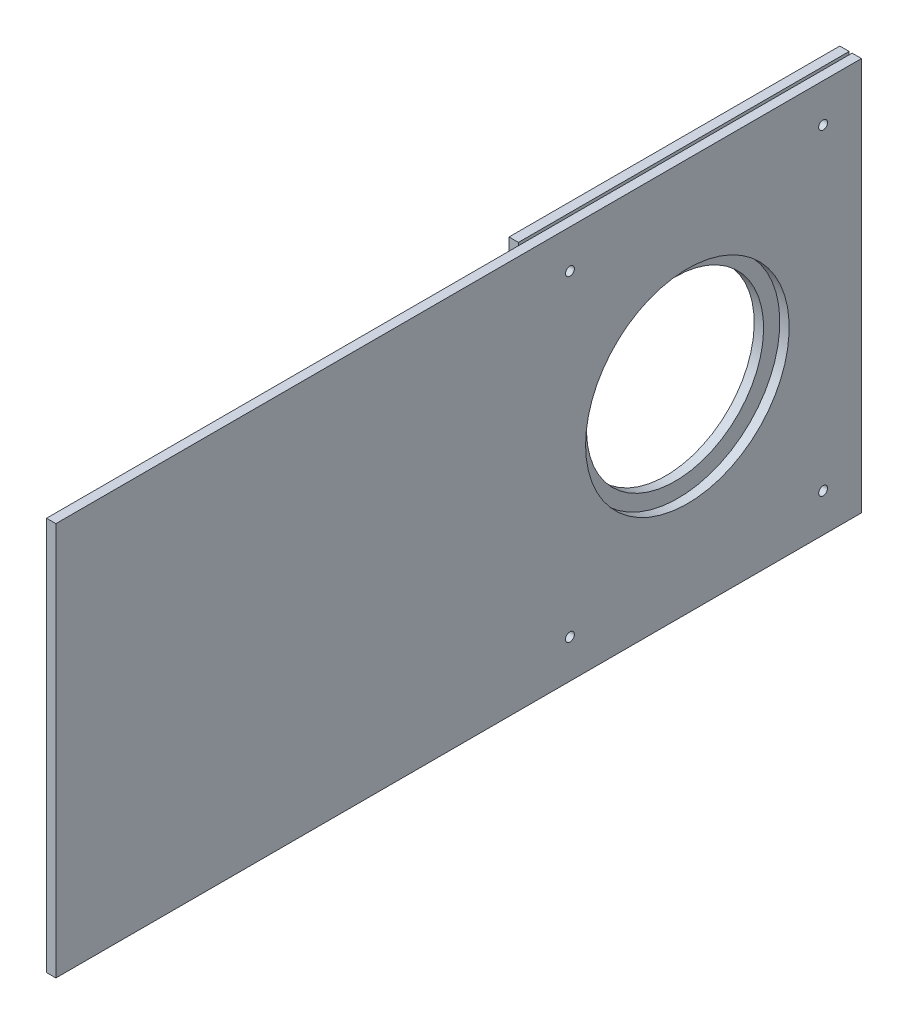
ISO-10303-21;
HEADER;
FILE_DESCRIPTION(('STEP AP214'),'2;1');
FILE_NAME('part.step','',(''),(''),'','','');
FILE_SCHEMA(('AUTOMOTIVE_DESIGN { 1 0 10303 214 1 1 1 1 }'));
ENDSEC;
DATA;
#1=APPLICATION_CONTEXT('core data for automotive mechanical design processes');
#2=APPLICATION_PROTOCOL_DEFINITION('international standard','automotive_design',2000,#1);
#3=PRODUCT_CONTEXT('',#1,'mechanical');
#4=PRODUCT('Part','Part','',(#3));
#5=PRODUCT_RELATED_PRODUCT_CATEGORY('part','',(#4));
#6=PRODUCT_DEFINITION_FORMATION('','',#4);
#7=PRODUCT_DEFINITION_CONTEXT('part definition',#1,'design');
#8=PRODUCT_DEFINITION('design','',#6,#7);
#9=PRODUCT_DEFINITION_SHAPE('','',#8);
#10=(LENGTH_UNIT() NAMED_UNIT(*) SI_UNIT(.MILLI.,.METRE.));
#11=(NAMED_UNIT(*) PLANE_ANGLE_UNIT() SI_UNIT($,.RADIAN.));
#12=(NAMED_UNIT(*) SI_UNIT($,.STERADIAN.) SOLID_ANGLE_UNIT());
#13=UNCERTAINTY_MEASURE_WITH_UNIT(LENGTH_MEASURE(1.E-05),#10,'distance_accuracy_value','');
#14=(GEOMETRIC_REPRESENTATION_CONTEXT(3) GLOBAL_UNCERTAINTY_ASSIGNED_CONTEXT((#13)) GLOBAL_UNIT_ASSIGNED_CONTEXT((#10,
#11,#12)) REPRESENTATION_CONTEXT('',''));
#15=CARTESIAN_POINT('',(0.,0.,0.));
#16=DIRECTION('',(0.,0.,1.));
#17=DIRECTION('',(1.,0.,0.));
#18=AXIS2_PLACEMENT_3D('',#15,#16,#17);
#19=CARTESIAN_POINT('',(-148.584589485562,66.675,273.));
#20=DIRECTION('',(1.,0.,0.));
#21=DIRECTION('',(0.,1.,0.));
#22=AXIS2_PLACEMENT_3D('',#19,#20,#21);
#23=PLANE('',#22);
#24=CARTESIAN_POINT('',(-148.584589485562,-53.675,13.));
#25=DIRECTION('',(1.,0.,0.));
#26=DIRECTION('',(0.,1.,0.));
#27=AXIS2_PLACEMENT_3D('',#24,#25,#26);
#28=CIRCLE('',#27,1.5);
#29=CARTESIAN_POINT('',(-148.584589485562,-52.175,13.));
#30=VERTEX_POINT('',#29);
#31=EDGE_CURVE('E141',#30,#30,#28,.F.);
#32=ORIENTED_EDGE('',*,*,#31,.F.);
#33=EDGE_LOOP('',(#32));
#34=FACE_BOUND('',#33,.T.);
#35=CARTESIAN_POINT('',(-148.584589485562,53.675,13.));
#36=DIRECTION('',(1.,0.,0.));
#37=DIRECTION('',(0.,1.,0.));
#38=AXIS2_PLACEMENT_3D('',#35,#36,#37);
#39=CIRCLE('',#38,1.5);
#40=CARTESIAN_POINT('',(-148.584589485562,55.175,13.));
#41=VERTEX_POINT('',#40);
#42=EDGE_CURVE('E136',#41,#41,#39,.F.);
#43=ORIENTED_EDGE('',*,*,#42,.F.);
#44=EDGE_LOOP('',(#43));
#45=FACE_BOUND('',#44,.T.);
#46=CARTESIAN_POINT('',(-148.584589485562,-53.675,98.7970297029699));
#47=DIRECTION('',(1.,0.,0.));
#48=DIRECTION('',(0.,1.,0.));
#49=AXIS2_PLACEMENT_3D('',#46,#47,#48);
#50=CIRCLE('',#49,1.5);
#51=CARTESIAN_POINT('',(-148.584589485562,-52.175,98.7970297029699));
#52=VERTEX_POINT('',#51);
#53=EDGE_CURVE('E131',#52,#52,#50,.F.);
#54=ORIENTED_EDGE('',*,*,#53,.F.);
#55=EDGE_LOOP('',(#54));
#56=FACE_BOUND('',#55,.T.);
#57=CARTESIAN_POINT('',(-148.584589485562,53.675,98.7970297029699));
#58=DIRECTION('',(1.,0.,0.));
#59=DIRECTION('',(0.,1.,0.));
#60=AXIS2_PLACEMENT_3D('',#57,#58,#59);
#61=CIRCLE('',#60,1.5);
#62=CARTESIAN_POINT('',(-148.584589485562,55.175,98.7970297029699));
#63=VERTEX_POINT('',#62);
#64=EDGE_CURVE('E126',#63,#63,#61,.F.);
#65=ORIENTED_EDGE('',*,*,#64,.F.);
#66=EDGE_LOOP('',(#65));
#67=FACE_BOUND('',#66,.T.);
#68=CARTESIAN_POINT('',(-148.584589485562,0.,59.));
#69=DIRECTION('',(1.,0.,0.));
#70=DIRECTION('',(0.,1.,0.));
#71=AXIS2_PLACEMENT_3D('',#68,#69,#70);
#72=CIRCLE('',#71,30.);
#73=CARTESIAN_POINT('',(-148.584589485562,30.,59.));
#74=VERTEX_POINT('',#73);
#75=EDGE_CURVE('E148',#74,#74,#72,.T.);
#76=ORIENTED_EDGE('',*,*,#75,.T.);
#77=EDGE_LOOP('',(#76));
#78=FACE_BOUND('',#77,.T.);
#79=DIRECTION('',(0.,0.,-1.));
#80=VECTOR('',#79,1.);
#81=CARTESIAN_POINT('',(-148.584589485562,-66.675,273.));
#82=LINE('',#81,#80);
#83=CARTESIAN_POINT('',(-148.584589485562,-66.675,112.08800484365));
#84=VERTEX_POINT('',#83);
#85=CARTESIAN_POINT('',(-148.584589485562,-66.675,0.));
#86=VERTEX_POINT('',#85);
#87=EDGE_CURVE('E62',#84,#86,#82,.T.);
#88=ORIENTED_EDGE('',*,*,#87,.F.);
#89=DIRECTION('',(0.,1.,0.));
#90=VECTOR('',#89,1.);
#91=CARTESIAN_POINT('',(-148.584589485562,66.675,112.08800484365));
#92=LINE('',#91,#90);
#93=CARTESIAN_POINT('',(-148.584589485562,66.675,112.08800484365));
#94=VERTEX_POINT('',#93);
#95=EDGE_CURVE('E94',#84,#94,#92,.T.);
#96=ORIENTED_EDGE('',*,*,#95,.T.);
#97=DIRECTION('',(0.,0.,-1.));
#98=VECTOR('',#97,1.);
#99=CARTESIAN_POINT('',(-148.584589485562,66.675,273.));
#100=LINE('',#99,#98);
#101=CARTESIAN_POINT('',(-148.584589485562,66.675,0.));
#102=VERTEX_POINT('',#101);
#103=EDGE_CURVE('E76',#94,#102,#100,.T.);
#104=ORIENTED_EDGE('',*,*,#103,.T.);
#105=DIRECTION('',(0.,-1.,0.));
#106=VECTOR('',#105,1.);
#107=CARTESIAN_POINT('',(-148.584589485562,66.675,0.));
#108=LINE('',#107,#106);
#109=EDGE_CURVE('E152',#102,#86,#108,.T.);
#110=ORIENTED_EDGE('',*,*,#109,.T.);
#111=EDGE_LOOP('',(#88,#96,#104,#110));
#112=FACE_BOUND('',#111,.T.);
#113=ADVANCED_FACE('F55',(#34,#45,#56,#67,#78,#112),#23,.F.);
#114=CARTESIAN_POINT('',(-148.584589485562,-66.675,273.));
#115=DIRECTION('',(0.,1.,0.));
#116=DIRECTION('',(0.,0.,1.));
#117=AXIS2_PLACEMENT_3D('',#114,#115,#116);
#118=PLANE('',#117);
#119=DIRECTION('',(0.,0.,-1.));
#120=VECTOR('',#119,1.);
#121=CARTESIAN_POINT('',(-145.409589485562,-66.675,273.));
#122=LINE('',#121,#120);
#123=CARTESIAN_POINT('',(-145.409589485562,-66.675,112.08800484365));
#124=VERTEX_POINT('',#123);
#125=CARTESIAN_POINT('',(-145.409589485562,-66.675,0.));
#126=VERTEX_POINT('',#125);
#127=EDGE_CURVE('E111',#124,#126,#122,.T.);
#128=ORIENTED_EDGE('',*,*,#127,.F.);
#129=DIRECTION('',(-1.,0.,0.));
#130=VECTOR('',#129,1.);
#131=CARTESIAN_POINT('',(-148.584589485562,-66.675,112.08800484365));
#132=LINE('',#131,#130);
#133=EDGE_CURVE('E101',#124,#84,#132,.T.);
#134=ORIENTED_EDGE('',*,*,#133,.T.);
#135=ORIENTED_EDGE('',*,*,#87,.T.);
#136=DIRECTION('',(1.,0.,0.));
#137=VECTOR('',#136,1.);
#138=CARTESIAN_POINT('',(-148.584589485562,-66.675,0.));
#139=LINE('',#138,#137);
#140=EDGE_CURVE('E155',#86,#126,#139,.T.);
#141=ORIENTED_EDGE('',*,*,#140,.T.);
#142=EDGE_LOOP('',(#128,#134,#135,#141));
#143=FACE_BOUND('',#142,.T.);
#144=ADVANCED_FACE('F166',(#143),#118,.F.);
#145=CARTESIAN_POINT('',(-145.409589485562,66.675,273.));
#146=DIRECTION('',(-1.,0.,0.));
#147=DIRECTION('',(0.,-1.,0.));
#148=AXIS2_PLACEMENT_3D('',#145,#146,#147);
#149=PLANE('',#148);
#150=CARTESIAN_POINT('',(-145.409589485562,-53.675,13.));
#151=DIRECTION('',(-1.,0.,0.));
#152=DIRECTION('',(0.,-1.,0.));
#153=AXIS2_PLACEMENT_3D('',#150,#151,#152);
#154=CIRCLE('',#153,1.5);
#155=CARTESIAN_POINT('',(-145.409589485562,-55.175,13.));
#156=VERTEX_POINT('',#155);
#157=EDGE_CURVE('E140',#156,#156,#154,.F.);
#158=ORIENTED_EDGE('',*,*,#157,.F.);
#159=EDGE_LOOP('',(#158));
#160=FACE_BOUND('',#159,.T.);
#161=CARTESIAN_POINT('',(-145.409589485562,53.675,13.));
#162=DIRECTION('',(-1.,0.,0.));
#163=DIRECTION('',(0.,-1.,0.));
#164=AXIS2_PLACEMENT_3D('',#161,#162,#163);
#165=CIRCLE('',#164,1.5);
#166=CARTESIAN_POINT('',(-145.409589485562,52.175,13.));
#167=VERTEX_POINT('',#166);
#168=EDGE_CURVE('E135',#167,#167,#165,.F.);
#169=ORIENTED_EDGE('',*,*,#168,.F.);
#170=EDGE_LOOP('',(#169));
#171=FACE_BOUND('',#170,.T.);
#172=CARTESIAN_POINT('',(-145.409589485562,-53.675,98.7970297029699));
#173=DIRECTION('',(-1.,0.,0.));
#174=DIRECTION('',(0.,-1.,0.));
#175=AXIS2_PLACEMENT_3D('',#172,#173,#174);
#176=CIRCLE('',#175,1.5);
#177=CARTESIAN_POINT('',(-145.409589485562,-55.175,98.7970297029699));
#178=VERTEX_POINT('',#177);
#179=EDGE_CURVE('E130',#178,#178,#176,.F.);
#180=ORIENTED_EDGE('',*,*,#179,.F.);
#181=EDGE_LOOP('',(#180));
#182=FACE_BOUND('',#181,.T.);
#183=CARTESIAN_POINT('',(-145.409589485562,53.675,98.7970297029699));
#184=DIRECTION('',(-1.,0.,0.));
#185=DIRECTION('',(0.,-1.,0.));
#186=AXIS2_PLACEMENT_3D('',#183,#184,#185);
#187=CIRCLE('',#186,1.5);
#188=CARTESIAN_POINT('',(-145.409589485562,52.175,98.7970297029699));
#189=VERTEX_POINT('',#188);
#190=EDGE_CURVE('E100',#189,#189,#187,.F.);
#191=ORIENTED_EDGE('',*,*,#190,.F.);
#192=EDGE_LOOP('',(#191));
#193=FACE_BOUND('',#192,.T.);
#194=CARTESIAN_POINT('',(-145.409589485562,0.,59.));
#195=DIRECTION('',(1.,0.,0.));
#196=DIRECTION('',(0.,1.,0.));
#197=AXIS2_PLACEMENT_3D('',#194,#195,#196);
#198=CIRCLE('',#197,30.);
#199=CARTESIAN_POINT('',(-145.409589485562,30.,59.));
#200=VERTEX_POINT('',#199);
#201=EDGE_CURVE('E145',#200,#200,#198,.T.);
#202=ORIENTED_EDGE('',*,*,#201,.F.);
#203=EDGE_LOOP('',(#202));
#204=FACE_BOUND('',#203,.T.);
#205=DIRECTION('',(0.,0.,-1.));
#206=VECTOR('',#205,1.);
#207=CARTESIAN_POINT('',(-145.409589485562,66.675,273.));
#208=LINE('',#207,#206);
#209=CARTESIAN_POINT('',(-145.409589485562,66.675,112.08800484365));
#210=VERTEX_POINT('',#209);
#211=CARTESIAN_POINT('',(-145.409589485562,66.675,0.));
#212=VERTEX_POINT('',#211);
#213=EDGE_CURVE('E108',#210,#212,#208,.T.);
#214=ORIENTED_EDGE('',*,*,#213,.F.);
#215=DIRECTION('',(0.,-1.,0.));
#216=VECTOR('',#215,1.);
#217=CARTESIAN_POINT('',(-145.409589485562,66.675,112.08800484365));
#218=LINE('',#217,#216);
#219=EDGE_CURVE('E69',#210,#124,#218,.T.);
#220=ORIENTED_EDGE('',*,*,#219,.T.);
#221=ORIENTED_EDGE('',*,*,#127,.T.);
#222=DIRECTION('',(0.,1.,0.));
#223=VECTOR('',#222,1.);
#224=CARTESIAN_POINT('',(-145.409589485562,66.675,0.));
#225=LINE('',#224,#223);
#226=EDGE_CURVE('E113',#126,#212,#225,.T.);
#227=ORIENTED_EDGE('',*,*,#226,.T.);
#228=EDGE_LOOP('',(#214,#220,#221,#227));
#229=FACE_BOUND('',#228,.T.);
#230=ADVANCED_FACE('F160',(#160,#171,#182,#193,#204,#229),#149,.F.);
#231=CARTESIAN_POINT('',(-148.584589485562,66.675,273.));
#232=DIRECTION('',(0.,-1.,0.));
#233=DIRECTION('',(0.,0.,-1.));
#234=AXIS2_PLACEMENT_3D('',#231,#232,#233);
#235=PLANE('',#234);
#236=ORIENTED_EDGE('',*,*,#103,.F.);
#237=DIRECTION('',(1.,0.,0.));
#238=VECTOR('',#237,1.);
#239=CARTESIAN_POINT('',(-148.584589485562,66.675,112.08800484365));
#240=LINE('',#239,#238);
#241=EDGE_CURVE('E13',#94,#210,#240,.T.);
#242=ORIENTED_EDGE('',*,*,#241,.T.);
#243=ORIENTED_EDGE('',*,*,#213,.T.);
#244=DIRECTION('',(-1.,0.,0.));
#245=VECTOR('',#244,1.);
#246=CARTESIAN_POINT('',(-148.584589485562,66.675,0.));
#247=LINE('',#246,#245);
#248=EDGE_CURVE('E105',#212,#102,#247,.T.);
#249=ORIENTED_EDGE('',*,*,#248,.T.);
#250=EDGE_LOOP('',(#236,#242,#243,#249));
#251=FACE_BOUND('',#250,.T.);
#252=ADVANCED_FACE('F103',(#251),#235,.F.);
#253=CARTESIAN_POINT('',(0.,0.,0.));
#254=DIRECTION('',(0.,0.,1.));
#255=DIRECTION('',(1.,0.,0.));
#256=AXIS2_PLACEMENT_3D('',#253,#254,#255);
#257=PLANE('',#256);
#258=ORIENTED_EDGE('',*,*,#109,.F.);
#259=ORIENTED_EDGE('',*,*,#248,.F.);
#260=ORIENTED_EDGE('',*,*,#226,.F.);
#261=ORIENTED_EDGE('',*,*,#140,.F.);
#262=EDGE_LOOP('',(#258,#259,#260,#261));
#263=FACE_BOUND('',#262,.T.);
#264=ADVANCED_FACE('F164',(#263),#257,.F.);
#265=CARTESIAN_POINT('',(-440.409589485562,0.,59.));
#266=DIRECTION('',(1.,0.,0.));
#267=DIRECTION('',(0.,1.,0.));
#268=AXIS2_PLACEMENT_3D('',#265,#266,#267);
#269=CYLINDRICAL_SURFACE('',#268,30.);
#270=ORIENTED_EDGE('',*,*,#201,.T.);
#271=EDGE_LOOP('',(#270));
#272=FACE_BOUND('',#271,.T.);
#273=ORIENTED_EDGE('',*,*,#75,.F.);
#274=EDGE_LOOP('',(#273));
#275=FACE_BOUND('',#274,.T.);
#276=ADVANCED_FACE('F192',(#272,#275),#269,.F.);
#277=CARTESIAN_POINT('',(-151.584589485562,53.675,98.7970297029699));
#278=DIRECTION('',(1.,0.,0.));
#279=DIRECTION('',(0.,1.,0.));
#280=AXIS2_PLACEMENT_3D('',#277,#278,#279);
#281=CYLINDRICAL_SURFACE('',#280,1.5);
#282=ORIENTED_EDGE('',*,*,#190,.T.);
#283=EDGE_LOOP('',(#282));
#284=FACE_BOUND('',#283,.T.);
#285=ORIENTED_EDGE('',*,*,#64,.T.);
#286=EDGE_LOOP('',(#285));
#287=FACE_BOUND('',#286,.T.);
#288=ADVANCED_FACE('F195',(#284,#287),#281,.F.);
#289=CARTESIAN_POINT('',(-151.584589485562,-53.675,98.7970297029699));
#290=DIRECTION('',(1.,0.,0.));
#291=DIRECTION('',(0.,1.,0.));
#292=AXIS2_PLACEMENT_3D('',#289,#290,#291);
#293=CYLINDRICAL_SURFACE('',#292,1.5);
#294=ORIENTED_EDGE('',*,*,#179,.T.);
#295=EDGE_LOOP('',(#294));
#296=FACE_BOUND('',#295,.T.);
#297=ORIENTED_EDGE('',*,*,#53,.T.);
#298=EDGE_LOOP('',(#297));
#299=FACE_BOUND('',#298,.T.);
#300=ADVANCED_FACE('F213',(#296,#299),#293,.F.);
#301=CARTESIAN_POINT('',(-151.584589485562,53.675,13.));
#302=DIRECTION('',(1.,0.,0.));
#303=DIRECTION('',(0.,1.,0.));
#304=AXIS2_PLACEMENT_3D('',#301,#302,#303);
#305=CYLINDRICAL_SURFACE('',#304,1.5);
#306=ORIENTED_EDGE('',*,*,#168,.T.);
#307=EDGE_LOOP('',(#306));
#308=FACE_BOUND('',#307,.T.);
#309=ORIENTED_EDGE('',*,*,#42,.T.);
#310=EDGE_LOOP('',(#309));
#311=FACE_BOUND('',#310,.T.);
#312=ADVANCED_FACE('F219',(#308,#311),#305,.F.);
#313=CARTESIAN_POINT('',(-151.584589485562,-53.675,13.));
#314=DIRECTION('',(1.,0.,0.));
#315=DIRECTION('',(0.,1.,0.));
#316=AXIS2_PLACEMENT_3D('',#313,#314,#315);
#317=CYLINDRICAL_SURFACE('',#316,1.5);
#318=ORIENTED_EDGE('',*,*,#157,.T.);
#319=EDGE_LOOP('',(#318));
#320=FACE_BOUND('',#319,.T.);
#321=ORIENTED_EDGE('',*,*,#31,.T.);
#322=EDGE_LOOP('',(#321));
#323=FACE_BOUND('',#322,.T.);
#324=ADVANCED_FACE('F178',(#320,#323),#317,.F.);
#325=CARTESIAN_POINT('',(-144.584589485562,68.353586437781,112.08800484365));
#326=DIRECTION('',(0.,0.,-1.));
#327=DIRECTION('',(-1.,0.,0.));
#328=AXIS2_PLACEMENT_3D('',#325,#326,#327);
#329=PLANE('',#328);
#330=ORIENTED_EDGE('',*,*,#133,.F.);
#331=ORIENTED_EDGE('',*,*,#219,.F.);
#332=ORIENTED_EDGE('',*,*,#241,.F.);
#333=ORIENTED_EDGE('',*,*,#95,.F.);
#334=EDGE_LOOP('',(#330,#331,#332,#333));
#335=FACE_BOUND('',#334,.T.);
#336=ADVANCED_FACE('F93',(#335),#329,.F.);
#337=CLOSED_SHELL('',(#113,#144,#230,#252,#264,#276,#288,#300,#312,#324,#336));
#338=MANIFOLD_SOLID_BREP('B2',#337);
#339=CARTESIAN_POINT('',(-144.409589485562,66.675,273.));
#340=DIRECTION('',(0.,-1.,0.));
#341=DIRECTION('',(0.,0.,-1.));
#342=AXIS2_PLACEMENT_3D('',#339,#340,#341);
#343=PLANE('',#342);
#344=DIRECTION('',(-1.,0.,0.));
#345=VECTOR('',#344,1.);
#346=CARTESIAN_POINT('',(-144.409589485562,66.675,0.));
#347=LINE('',#346,#345);
#348=CARTESIAN_POINT('',(-141.234589485562,66.675,0.));
#349=VERTEX_POINT('',#348);
#350=CARTESIAN_POINT('',(-144.409589485562,66.675,0.));
#351=VERTEX_POINT('',#350);
#352=EDGE_CURVE('E373',#349,#351,#347,.T.);
#353=ORIENTED_EDGE('',*,*,#352,.T.);
#354=DIRECTION('',(0.,0.,-1.));
#355=VECTOR('',#354,1.);
#356=CARTESIAN_POINT('',(-144.409589485562,66.675,273.));
#357=LINE('',#356,#355);
#358=CARTESIAN_POINT('',(-144.409589485562,66.675,273.));
#359=VERTEX_POINT('',#358);
#360=EDGE_CURVE('E53',#359,#351,#357,.T.);
#361=ORIENTED_EDGE('',*,*,#360,.F.);
#362=DIRECTION('',(-1.,0.,0.));
#363=VECTOR('',#362,1.);
#364=CARTESIAN_POINT('',(-144.409589485562,66.675,273.));
#365=LINE('',#364,#363);
#366=CARTESIAN_POINT('',(-141.234589485562,66.675,273.));
#367=VERTEX_POINT('',#366);
#368=EDGE_CURVE('E355',#367,#359,#365,.T.);
#369=ORIENTED_EDGE('',*,*,#368,.F.);
#370=DIRECTION('',(0.,0.,-1.));
#371=VECTOR('',#370,1.);
#372=CARTESIAN_POINT('',(-141.234589485562,66.675,273.));
#373=LINE('',#372,#371);
#374=EDGE_CURVE('E367',#367,#349,#373,.T.);
#375=ORIENTED_EDGE('',*,*,#374,.T.);
#376=EDGE_LOOP('',(#353,#361,#369,#375));
#377=FACE_BOUND('',#376,.T.);
#378=ADVANCED_FACE('F302',(#377),#343,.F.);
#379=CARTESIAN_POINT('',(-144.409589485562,66.675,273.));
#380=DIRECTION('',(1.,0.,0.));
#381=DIRECTION('',(0.,1.,0.));
#382=AXIS2_PLACEMENT_3D('',#379,#380,#381);
#383=PLANE('',#382);
#384=CARTESIAN_POINT('',(-144.409589485562,-53.675,13.));
#385=DIRECTION('',(1.,0.,0.));
#386=DIRECTION('',(0.,1.,0.));
#387=AXIS2_PLACEMENT_3D('',#384,#385,#386);
#388=CIRCLE('',#387,1.5);
#389=CARTESIAN_POINT('',(-144.409589485562,-52.175,13.));
#390=VERTEX_POINT('',#389);
#391=EDGE_CURVE('E404',#390,#390,#388,.F.);
#392=ORIENTED_EDGE('',*,*,#391,.F.);
#393=EDGE_LOOP('',(#392));
#394=FACE_BOUND('',#393,.T.);
#395=CARTESIAN_POINT('',(-144.409589485562,53.675,13.));
#396=DIRECTION('',(1.,0.,0.));
#397=DIRECTION('',(0.,1.,0.));
#398=AXIS2_PLACEMENT_3D('',#395,#396,#397);
#399=CIRCLE('',#398,1.5);
#400=CARTESIAN_POINT('',(-144.409589485562,55.175,13.));
#401=VERTEX_POINT('',#400);
#402=EDGE_CURVE('E417',#401,#401,#399,.F.);
#403=ORIENTED_EDGE('',*,*,#402,.F.);
#404=EDGE_LOOP('',(#403));
#405=FACE_BOUND('',#404,.T.);
#406=CARTESIAN_POINT('',(-144.409589485562,-53.675,98.7970297029699));
#407=DIRECTION('',(1.,0.,0.));
#408=DIRECTION('',(0.,1.,0.));
#409=AXIS2_PLACEMENT_3D('',#406,#407,#408);
#410=CIRCLE('',#409,1.5);
#411=CARTESIAN_POINT('',(-144.409589485562,-52.175,98.7970297029699));
#412=VERTEX_POINT('',#411);
#413=EDGE_CURVE('E413',#412,#412,#410,.F.);
#414=ORIENTED_EDGE('',*,*,#413,.F.);
#415=EDGE_LOOP('',(#414));
#416=FACE_BOUND('',#415,.T.);
#417=CARTESIAN_POINT('',(-144.409589485562,53.675,98.7970297029699));
#418=DIRECTION('',(1.,0.,0.));
#419=DIRECTION('',(0.,1.,0.));
#420=AXIS2_PLACEMENT_3D('',#417,#418,#419);
#421=CIRCLE('',#420,1.5);
#422=CARTESIAN_POINT('',(-144.409589485562,55.175,98.7970297029699));
#423=VERTEX_POINT('',#422);
#424=EDGE_CURVE('E409',#423,#423,#421,.F.);
#425=ORIENTED_EDGE('',*,*,#424,.F.);
#426=EDGE_LOOP('',(#425));
#427=FACE_BOUND('',#426,.T.);
#428=CARTESIAN_POINT('',(-144.409589485562,0.,59.));
#429=DIRECTION('',(1.,0.,0.));
#430=DIRECTION('',(0.,1.,0.));
#431=AXIS2_PLACEMENT_3D('',#428,#429,#430);
#432=CIRCLE('',#431,34.5);
#433=CARTESIAN_POINT('',(-144.409589485562,34.5,59.));
#434=VERTEX_POINT('',#433);
#435=EDGE_CURVE('E403',#434,#434,#432,.T.);
#436=ORIENTED_EDGE('',*,*,#435,.T.);
#437=EDGE_LOOP('',(#436));
#438=FACE_BOUND('',#437,.T.);
#439=DIRECTION('',(0.,-1.,0.));
#440=VECTOR('',#439,1.);
#441=CARTESIAN_POINT('',(-144.409589485562,66.675,0.));
#442=LINE('',#441,#440);
#443=CARTESIAN_POINT('',(-144.409589485562,-66.6750000000001,0.));
#444=VERTEX_POINT('',#443);
#445=EDGE_CURVE('E360',#351,#444,#442,.T.);
#446=ORIENTED_EDGE('',*,*,#445,.T.);
#447=DIRECTION('',(0.,0.,-1.));
#448=VECTOR('',#447,1.);
#449=CARTESIAN_POINT('',(-144.409589485562,-66.6750000000001,273.));
#450=LINE('',#449,#448);
#451=CARTESIAN_POINT('',(-144.409589485562,-66.6750000000001,273.));
#452=VERTEX_POINT('',#451);
#453=EDGE_CURVE('E312',#452,#444,#450,.T.);
#454=ORIENTED_EDGE('',*,*,#453,.F.);
#455=DIRECTION('',(0.,-1.,0.));
#456=VECTOR('',#455,1.);
#457=CARTESIAN_POINT('',(-144.409589485562,66.675,273.));
#458=LINE('',#457,#456);
#459=EDGE_CURVE('E350',#359,#452,#458,.T.);
#460=ORIENTED_EDGE('',*,*,#459,.F.);
#461=ORIENTED_EDGE('',*,*,#360,.T.);
#462=EDGE_LOOP('',(#446,#454,#460,#461));
#463=FACE_BOUND('',#462,.T.);
#464=ADVANCED_FACE('F359',(#394,#405,#416,#427,#438,#463),#383,.F.);
#465=CARTESIAN_POINT('',(-144.409589485562,-66.6750000000001,273.));
#466=DIRECTION('',(0.,1.,0.));
#467=DIRECTION('',(0.,0.,1.));
#468=AXIS2_PLACEMENT_3D('',#465,#466,#467);
#469=PLANE('',#468);
#470=DIRECTION('',(1.,0.,0.));
#471=VECTOR('',#470,1.);
#472=CARTESIAN_POINT('',(-144.409589485562,-66.6750000000001,0.));
#473=LINE('',#472,#471);
#474=CARTESIAN_POINT('',(-141.234589485562,-66.6750000000001,0.));
#475=VERTEX_POINT('',#474);
#476=EDGE_CURVE('E337',#444,#475,#473,.T.);
#477=ORIENTED_EDGE('',*,*,#476,.T.);
#478=DIRECTION('',(0.,0.,-1.));
#479=VECTOR('',#478,1.);
#480=CARTESIAN_POINT('',(-141.234589485562,-66.6750000000001,273.));
#481=LINE('',#480,#479);
#482=CARTESIAN_POINT('',(-141.234589485562,-66.6750000000001,273.));
#483=VERTEX_POINT('',#482);
#484=EDGE_CURVE('E362',#483,#475,#481,.T.);
#485=ORIENTED_EDGE('',*,*,#484,.F.);
#486=DIRECTION('',(1.,0.,0.));
#487=VECTOR('',#486,1.);
#488=CARTESIAN_POINT('',(-144.409589485562,-66.6750000000001,273.));
#489=LINE('',#488,#487);
#490=EDGE_CURVE('E353',#452,#483,#489,.T.);
#491=ORIENTED_EDGE('',*,*,#490,.F.);
#492=ORIENTED_EDGE('',*,*,#453,.T.);
#493=EDGE_LOOP('',(#477,#485,#491,#492));
#494=FACE_BOUND('',#493,.T.);
#495=ADVANCED_FACE('F364',(#494),#469,.F.);
#496=CARTESIAN_POINT('',(-141.234589485562,66.675,273.));
#497=DIRECTION('',(-1.,0.,0.));
#498=DIRECTION('',(0.,0.,1.));
#499=AXIS2_PLACEMENT_3D('',#496,#497,#498);
#500=PLANE('',#499);
#501=CARTESIAN_POINT('',(-141.234589485562,-53.675,13.));
#502=DIRECTION('',(-1.,0.,0.));
#503=DIRECTION('',(0.,0.,1.));
#504=AXIS2_PLACEMENT_3D('',#501,#502,#503);
#505=CIRCLE('',#504,1.5);
#506=CARTESIAN_POINT('',(-141.234589485562,-53.675,14.5));
#507=VERTEX_POINT('',#506);
#508=EDGE_CURVE('E305',#507,#507,#505,.F.);
#509=ORIENTED_EDGE('',*,*,#508,.F.);
#510=EDGE_LOOP('',(#509));
#511=FACE_BOUND('',#510,.T.);
#512=CARTESIAN_POINT('',(-141.234589485562,53.675,13.));
#513=DIRECTION('',(-1.,0.,0.));
#514=DIRECTION('',(0.,0.,1.));
#515=AXIS2_PLACEMENT_3D('',#512,#513,#514);
#516=CIRCLE('',#515,1.5);
#517=CARTESIAN_POINT('',(-141.234589485562,53.675,14.5));
#518=VERTEX_POINT('',#517);
#519=EDGE_CURVE('E414',#518,#518,#516,.F.);
#520=ORIENTED_EDGE('',*,*,#519,.F.);
#521=EDGE_LOOP('',(#520));
#522=FACE_BOUND('',#521,.T.);
#523=CARTESIAN_POINT('',(-141.234589485562,-53.675,98.7970297029699));
#524=DIRECTION('',(-1.,0.,0.));
#525=DIRECTION('',(0.,0.,1.));
#526=AXIS2_PLACEMENT_3D('',#523,#524,#525);
#527=CIRCLE('',#526,1.5);
#528=CARTESIAN_POINT('',(-141.234589485562,-53.675,100.29702970297));
#529=VERTEX_POINT('',#528);
#530=EDGE_CURVE('E410',#529,#529,#527,.F.);
#531=ORIENTED_EDGE('',*,*,#530,.F.);
#532=EDGE_LOOP('',(#531));
#533=FACE_BOUND('',#532,.T.);
#534=CARTESIAN_POINT('',(-141.234589485562,53.675,98.7970297029699));
#535=DIRECTION('',(-1.,0.,0.));
#536=DIRECTION('',(0.,0.,1.));
#537=AXIS2_PLACEMENT_3D('',#534,#535,#536);
#538=CIRCLE('',#537,1.5);
#539=CARTESIAN_POINT('',(-141.234589485562,53.675,100.29702970297));
#540=VERTEX_POINT('',#539);
#541=EDGE_CURVE('E405',#540,#540,#538,.F.);
#542=ORIENTED_EDGE('',*,*,#541,.F.);
#543=EDGE_LOOP('',(#542));
#544=FACE_BOUND('',#543,.T.);
#545=CARTESIAN_POINT('',(-141.234589485562,0.,59.));
#546=DIRECTION('',(-1.,0.,0.));
#547=DIRECTION('',(0.,0.,1.));
#548=AXIS2_PLACEMENT_3D('',#545,#546,#547);
#549=CIRCLE('',#548,34.5);
#550=CARTESIAN_POINT('',(-141.234589485562,0.,93.5));
#551=VERTEX_POINT('',#550);
#552=EDGE_CURVE('E398',#551,#551,#549,.T.);
#553=ORIENTED_EDGE('',*,*,#552,.T.);
#554=EDGE_LOOP('',(#553));
#555=FACE_BOUND('',#554,.T.);
#556=DIRECTION('',(0.,1.,0.));
#557=VECTOR('',#556,1.);
#558=CARTESIAN_POINT('',(-141.234589485562,66.675,0.));
#559=LINE('',#558,#557);
#560=EDGE_CURVE('E343',#475,#349,#559,.T.);
#561=ORIENTED_EDGE('',*,*,#560,.T.);
#562=ORIENTED_EDGE('',*,*,#374,.F.);
#563=DIRECTION('',(0.,1.,0.));
#564=VECTOR('',#563,1.);
#565=CARTESIAN_POINT('',(-141.234589485562,66.675,273.));
#566=LINE('',#565,#564);
#567=EDGE_CURVE('E320',#483,#367,#566,.T.);
#568=ORIENTED_EDGE('',*,*,#567,.F.);
#569=ORIENTED_EDGE('',*,*,#484,.T.);
#570=EDGE_LOOP('',(#561,#562,#568,#569));
#571=FACE_BOUND('',#570,.T.);
#572=ADVANCED_FACE('F454',(#511,#522,#533,#544,#555,#571),#500,.F.);
#573=CARTESIAN_POINT('',(0.,0.,273.));
#574=DIRECTION('',(0.,0.,-1.));
#575=DIRECTION('',(-1.,0.,0.));
#576=AXIS2_PLACEMENT_3D('',#573,#574,#575);
#577=PLANE('',#576);
#578=ORIENTED_EDGE('',*,*,#368,.T.);
#579=ORIENTED_EDGE('',*,*,#459,.T.);
#580=ORIENTED_EDGE('',*,*,#490,.T.);
#581=ORIENTED_EDGE('',*,*,#567,.T.);
#582=EDGE_LOOP('',(#578,#579,#580,#581));
#583=FACE_BOUND('',#582,.T.);
#584=ADVANCED_FACE('F351',(#583),#577,.F.);
#585=CARTESIAN_POINT('',(0.,0.,0.));
#586=DIRECTION('',(0.,0.,-1.));
#587=DIRECTION('',(-1.,0.,0.));
#588=AXIS2_PLACEMENT_3D('',#585,#586,#587);
#589=PLANE('',#588);
#590=ORIENTED_EDGE('',*,*,#352,.F.);
#591=ORIENTED_EDGE('',*,*,#560,.F.);
#592=ORIENTED_EDGE('',*,*,#476,.F.);
#593=ORIENTED_EDGE('',*,*,#445,.F.);
#594=EDGE_LOOP('',(#590,#591,#592,#593));
#595=FACE_BOUND('',#594,.T.);
#596=ADVANCED_FACE('F443',(#595),#589,.T.);
#597=CARTESIAN_POINT('',(-131.409589485562,0.,59.));
#598=DIRECTION('',(-1.,0.,0.));
#599=DIRECTION('',(0.,0.,1.));
#600=AXIS2_PLACEMENT_3D('',#597,#598,#599);
#601=CYLINDRICAL_SURFACE('',#600,34.5);
#602=ORIENTED_EDGE('',*,*,#552,.F.);
#603=EDGE_LOOP('',(#602));
#604=FACE_BOUND('',#603,.T.);
#605=ORIENTED_EDGE('',*,*,#435,.F.);
#606=EDGE_LOOP('',(#605));
#607=FACE_BOUND('',#606,.T.);
#608=ADVANCED_FACE('F445',(#604,#607),#601,.F.);
#609=CARTESIAN_POINT('',(-151.584589485562,53.675,98.7970297029699));
#610=DIRECTION('',(1.,0.,0.));
#611=DIRECTION('',(0.,1.,0.));
#612=AXIS2_PLACEMENT_3D('',#609,#610,#611);
#613=CYLINDRICAL_SURFACE('',#612,1.5);
#614=ORIENTED_EDGE('',*,*,#541,.T.);
#615=EDGE_LOOP('',(#614));
#616=FACE_BOUND('',#615,.T.);
#617=ORIENTED_EDGE('',*,*,#424,.T.);
#618=EDGE_LOOP('',(#617));
#619=FACE_BOUND('',#618,.T.);
#620=ADVANCED_FACE('F451',(#616,#619),#613,.F.);
#621=CARTESIAN_POINT('',(-151.584589485562,-53.675,98.7970297029699));
#622=DIRECTION('',(1.,0.,0.));
#623=DIRECTION('',(0.,1.,0.));
#624=AXIS2_PLACEMENT_3D('',#621,#622,#623);
#625=CYLINDRICAL_SURFACE('',#624,1.5);
#626=ORIENTED_EDGE('',*,*,#530,.T.);
#627=EDGE_LOOP('',(#626));
#628=FACE_BOUND('',#627,.T.);
#629=ORIENTED_EDGE('',*,*,#413,.T.);
#630=EDGE_LOOP('',(#629));
#631=FACE_BOUND('',#630,.T.);
#632=ADVANCED_FACE('F485',(#628,#631),#625,.F.);
#633=CARTESIAN_POINT('',(-151.584589485562,53.675,13.));
#634=DIRECTION('',(1.,0.,0.));
#635=DIRECTION('',(0.,1.,0.));
#636=AXIS2_PLACEMENT_3D('',#633,#634,#635);
#637=CYLINDRICAL_SURFACE('',#636,1.5);
#638=ORIENTED_EDGE('',*,*,#519,.T.);
#639=EDGE_LOOP('',(#638));
#640=FACE_BOUND('',#639,.T.);
#641=ORIENTED_EDGE('',*,*,#402,.T.);
#642=EDGE_LOOP('',(#641));
#643=FACE_BOUND('',#642,.T.);
#644=ADVANCED_FACE('F493',(#640,#643),#637,.F.);
#645=CARTESIAN_POINT('',(-151.584589485562,-53.675,13.));
#646=DIRECTION('',(1.,0.,0.));
#647=DIRECTION('',(0.,1.,0.));
#648=AXIS2_PLACEMENT_3D('',#645,#646,#647);
#649=CYLINDRICAL_SURFACE('',#648,1.5);
#650=ORIENTED_EDGE('',*,*,#508,.T.);
#651=EDGE_LOOP('',(#650));
#652=FACE_BOUND('',#651,.T.);
#653=ORIENTED_EDGE('',*,*,#391,.T.);
#654=EDGE_LOOP('',(#653));
#655=FACE_BOUND('',#654,.T.);
#656=ADVANCED_FACE('F499',(#652,#655),#649,.F.);
#657=CLOSED_SHELL('',(#378,#464,#495,#572,#584,#596,#608,#620,#632,#644,#656));
#658=MANIFOLD_SOLID_BREP('B7',#657);
#659=ADVANCED_BREP_SHAPE_REPRESENTATION('',(#18,#338,#658),#14);
#660=SHAPE_DEFINITION_REPRESENTATION(#9,#659);
ENDSEC;
END-ISO-10303-21;
